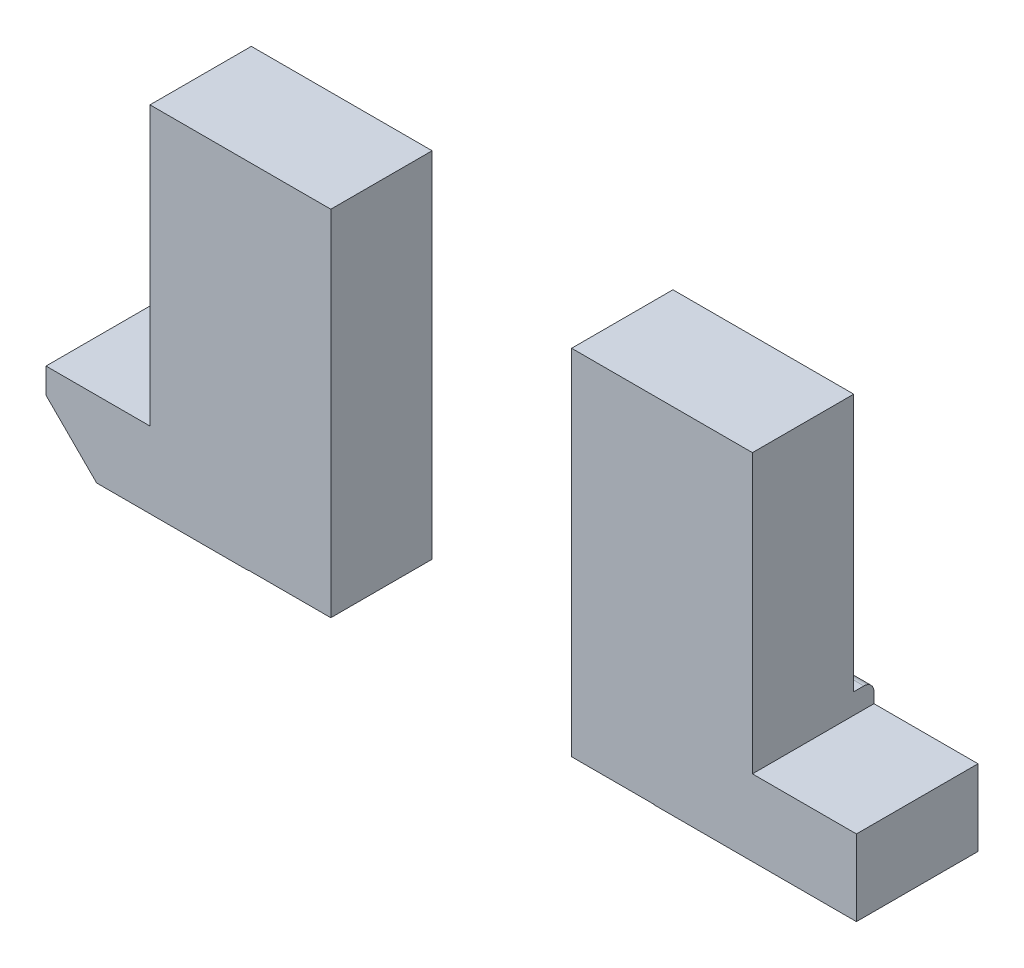
ISO-10303-21;
HEADER;
FILE_DESCRIPTION(('STEP AP214'),'2;1');
FILE_NAME('part.step','',(''),(''),'','','');
FILE_SCHEMA(('AUTOMOTIVE_DESIGN { 1 0 10303 214 1 1 1 1 }'));
ENDSEC;
DATA;
#1=APPLICATION_CONTEXT('core data for automotive mechanical design processes');
#2=APPLICATION_PROTOCOL_DEFINITION('international standard','automotive_design',2000,#1);
#3=PRODUCT_CONTEXT('',#1,'mechanical');
#4=PRODUCT('Part','Part','',(#3));
#5=PRODUCT_RELATED_PRODUCT_CATEGORY('part','',(#4));
#6=PRODUCT_DEFINITION_FORMATION('','',#4);
#7=PRODUCT_DEFINITION_CONTEXT('part definition',#1,'design');
#8=PRODUCT_DEFINITION('design','',#6,#7);
#9=PRODUCT_DEFINITION_SHAPE('','',#8);
#10=(LENGTH_UNIT() NAMED_UNIT(*) SI_UNIT(.MILLI.,.METRE.));
#11=(NAMED_UNIT(*) PLANE_ANGLE_UNIT() SI_UNIT($,.RADIAN.));
#12=(NAMED_UNIT(*) SI_UNIT($,.STERADIAN.) SOLID_ANGLE_UNIT());
#13=UNCERTAINTY_MEASURE_WITH_UNIT(LENGTH_MEASURE(1.E-05),#10,'distance_accuracy_value','');
#14=(GEOMETRIC_REPRESENTATION_CONTEXT(3) GLOBAL_UNCERTAINTY_ASSIGNED_CONTEXT((#13)) GLOBAL_UNIT_ASSIGNED_CONTEXT((#10,
#11,#12)) REPRESENTATION_CONTEXT('',''));
#15=CARTESIAN_POINT('',(0.,0.,0.));
#16=DIRECTION('',(0.,0.,1.));
#17=DIRECTION('',(1.,0.,0.));
#18=AXIS2_PLACEMENT_3D('',#15,#16,#17);
#19=CARTESIAN_POINT('',(-0.8,-0.2,0.));
#20=DIRECTION('',(0.,1.,0.));
#21=DIRECTION('',(1.,0.,0.));
#22=AXIS2_PLACEMENT_3D('',#19,#20,#21);
#23=PLANE('',#22);
#24=DIRECTION('',(1.,0.,0.));
#25=VECTOR('',#24,1.);
#26=CARTESIAN_POINT('',(0.,-0.2,0.02));
#27=LINE('',#26,#25);
#28=CARTESIAN_POINT('',(-0.8,-0.2,0.02));
#29=VERTEX_POINT('',#28);
#30=CARTESIAN_POINT('',(-0.594652416555,-0.2,0.02));
#31=VERTEX_POINT('',#30);
#32=EDGE_CURVE('P0_E200',#29,#31,#27,.T.);
#33=ORIENTED_EDGE('',*,*,#32,.F.);
#34=DIRECTION('',(0.,0.,-1.));
#35=VECTOR('',#34,1.);
#36=CARTESIAN_POINT('',(-0.8,-0.2,0.));
#37=LINE('',#36,#35);
#38=CARTESIAN_POINT('',(-0.8,-0.2,0.26));
#39=VERTEX_POINT('',#38);
#40=EDGE_CURVE('P0_E41',#39,#29,#37,.T.);
#41=ORIENTED_EDGE('',*,*,#40,.F.);
#42=DIRECTION('',(-1.,0.,0.));
#43=VECTOR('',#42,1.);
#44=CARTESIAN_POINT('',(0.,-0.2,0.26));
#45=LINE('',#44,#43);
#46=CARTESIAN_POINT('',(-0.594652416555,-0.2,0.26));
#47=VERTEX_POINT('',#46);
#48=EDGE_CURVE('P0_E226',#47,#39,#45,.T.);
#49=ORIENTED_EDGE('',*,*,#48,.F.);
#50=DIRECTION('',(0.,0.,1.));
#51=VECTOR('',#50,1.);
#52=CARTESIAN_POINT('',(-0.594652416555,-0.2,0.06885270012602));
#53=LINE('',#52,#51);
#54=EDGE_CURVE('P0_E27',#31,#47,#53,.T.);
#55=ORIENTED_EDGE('',*,*,#54,.F.);
#56=EDGE_LOOP('',(#33,#41,#49,#55));
#57=FACE_BOUND('',#56,.T.);
#58=ADVANCED_FACE('P0_F16',(#57),#23,.T.);
#59=CARTESIAN_POINT('',(-0.594652416555,-0.349252516346,0.26));
#60=DIRECTION('',(-1.,0.,0.));
#61=DIRECTION('',(0.,0.,1.));
#62=AXIS2_PLACEMENT_3D('',#59,#60,#61);
#63=PLANE('',#62);
#64=DIRECTION('',(0.,-1.,0.));
#65=VECTOR('',#64,1.);
#66=CARTESIAN_POINT('',(-0.594652416555,-0.129801770078,0.26));
#67=LINE('',#66,#65);
#68=CARTESIAN_POINT('',(-0.594652416555,0.349252516346,0.26));
#69=VERTEX_POINT('',#68);
#70=EDGE_CURVE('P0_E223',#69,#47,#67,.T.);
#71=ORIENTED_EDGE('',*,*,#70,.F.);
#72=DIRECTION('',(0.,0.,-1.));
#73=VECTOR('',#72,1.);
#74=CARTESIAN_POINT('',(-0.594652416555,0.349252516346,0.26));
#75=LINE('',#74,#73);
#76=CARTESIAN_POINT('',(-0.594652416555,0.349252516346,0.06));
#77=VERTEX_POINT('',#76);
#78=EDGE_CURVE('P0_E11',#69,#77,#75,.T.);
#79=ORIENTED_EDGE('',*,*,#78,.T.);
#80=DIRECTION('',(0.,1.,0.));
#81=VECTOR('',#80,1.);
#82=CARTESIAN_POINT('',(-0.594652416555,0.349252516346,0.06));
#83=LINE('',#82,#81);
#84=CARTESIAN_POINT('',(-0.594652416555,-0.159603540156,0.06));
#85=VERTEX_POINT('',#84);
#86=EDGE_CURVE('P0_E191',#85,#77,#83,.T.);
#87=ORIENTED_EDGE('',*,*,#86,.F.);
#88=DIRECTION('',(0.,0.,1.));
#89=VECTOR('',#88,1.);
#90=CARTESIAN_POINT('',(-0.594652416555,-0.159603540156,0.07885270012602));
#91=LINE('',#90,#89);
#92=CARTESIAN_POINT('',(-0.594652416555,-0.159603540156,0.04));
#93=VERTEX_POINT('',#92);
#94=EDGE_CURVE('P0_E269',#93,#85,#91,.T.);
#95=ORIENTED_EDGE('',*,*,#94,.F.);
#96=CARTESIAN_POINT('',(-0.594652416555,-0.179603540156,0.04));
#97=DIRECTION('',(1.,0.,0.));
#98=DIRECTION('',(0.,0.707106781186548,-0.707106781186548));
#99=AXIS2_PLACEMENT_3D('',#96,#97,#98);
#100=CIRCLE('',#99,0.02);
#101=CARTESIAN_POINT('',(-0.594652416555,-0.179603540156,0.02));
#102=VERTEX_POINT('',#101);
#103=EDGE_CURVE('P0_E175',#102,#93,#100,.T.);
#104=ORIENTED_EDGE('',*,*,#103,.F.);
#105=DIRECTION('',(0.,1.,0.));
#106=VECTOR('',#105,1.);
#107=CARTESIAN_POINT('',(-0.594652416555,-0.225,0.02));
#108=LINE('',#107,#106);
#109=EDGE_CURVE('P0_E217',#31,#102,#108,.T.);
#110=ORIENTED_EDGE('',*,*,#109,.F.);
#111=ORIENTED_EDGE('',*,*,#54,.T.);
#112=EDGE_LOOP('',(#71,#79,#87,#95,#104,#110,#111));
#113=FACE_BOUND('',#112,.T.);
#114=ADVANCED_FACE('P0_F291',(#113),#63,.T.);
#115=CARTESIAN_POINT('',(0.8,-0.159603540156,0.26));
#116=DIRECTION('',(0.,0.,1.));
#117=DIRECTION('',(1.,0.,0.));
#118=AXIS2_PLACEMENT_3D('',#115,#116,#117);
#119=PLANE('',#118);
#120=ORIENTED_EDGE('',*,*,#70,.T.);
#121=ORIENTED_EDGE('',*,*,#48,.T.);
#122=DIRECTION('',(0.,-1.,0.));
#123=VECTOR('',#122,1.);
#124=CARTESIAN_POINT('',(-0.8,0.2,0.26));
#125=LINE('',#124,#123);
#126=CARTESIAN_POINT('',(-0.8,-0.25,0.26));
#127=VERTEX_POINT('',#126);
#128=EDGE_CURVE('P0_E161',#39,#127,#125,.T.);
#129=ORIENTED_EDGE('',*,*,#128,.T.);
#130=DIRECTION('',(-0.707106781186548,0.707106781186548,0.));
#131=VECTOR('',#130,1.);
#132=CARTESIAN_POINT('',(-0.712899120865,-0.337100879135,0.26));
#133=LINE('',#132,#131);
#134=CARTESIAN_POINT('',(-0.7,-0.35,0.26));
#135=VERTEX_POINT('',#134);
#136=EDGE_CURVE('P0_E201',#135,#127,#133,.T.);
#137=ORIENTED_EDGE('',*,*,#136,.F.);
#138=DIRECTION('',(-1.,0.,0.));
#139=VECTOR('',#138,1.);
#140=CARTESIAN_POINT('',(-0.7,-0.35,0.26));
#141=LINE('',#140,#139);
#142=CARTESIAN_POINT('',(-0.4,-0.35,0.26));
#143=VERTEX_POINT('',#142);
#144=EDGE_CURVE('P0_E156',#143,#135,#141,.T.);
#145=ORIENTED_EDGE('',*,*,#144,.F.);
#146=DIRECTION('',(0.,1.,0.));
#147=VECTOR('',#146,1.);
#148=CARTESIAN_POINT('',(-0.4,0.172033539864,0.26));
#149=LINE('',#148,#147);
#150=CARTESIAN_POINT('',(-0.4,-0.349252516346,0.26));
#151=VERTEX_POINT('',#150);
#152=EDGE_CURVE('P0_E149',#143,#151,#149,.T.);
#153=ORIENTED_EDGE('',*,*,#152,.T.);
#154=DIRECTION('',(1.,0.,0.));
#155=VECTOR('',#154,1.);
#156=CARTESIAN_POINT('',(-0.594652416555,-0.349252516346,0.26));
#157=LINE('',#156,#155);
#158=CARTESIAN_POINT('',(-0.237707110887,-0.349252516346,0.26));
#159=VERTEX_POINT('',#158);
#160=EDGE_CURVE('P0_E140',#151,#159,#157,.T.);
#161=ORIENTED_EDGE('',*,*,#160,.T.);
#162=DIRECTION('',(0.,1.,0.));
#163=VECTOR('',#162,1.);
#164=CARTESIAN_POINT('',(-0.237707110887,-0.349252516346,0.26));
#165=LINE('',#164,#163);
#166=CARTESIAN_POINT('',(-0.237707110887,0.349252516346,0.26));
#167=VERTEX_POINT('',#166);
#168=EDGE_CURVE('P0_E150',#159,#167,#165,.T.);
#169=ORIENTED_EDGE('',*,*,#168,.T.);
#170=DIRECTION('',(-1.,0.,0.));
#171=VECTOR('',#170,1.);
#172=CARTESIAN_POINT('',(-0.237707110887,0.349252516346,0.26));
#173=LINE('',#172,#171);
#174=EDGE_CURVE('P0_E194',#167,#69,#173,.T.);
#175=ORIENTED_EDGE('',*,*,#174,.T.);
#176=EDGE_LOOP('',(#120,#121,#129,#137,#145,#153,#161,#169,#175));
#177=FACE_BOUND('',#176,.T.);
#178=ADVANCED_FACE('P0_F154',(#177),#119,.T.);
#179=CARTESIAN_POINT('',(-0.237707110887,-0.349252516346,0.26));
#180=DIRECTION('',(0.,-1.,0.));
#181=DIRECTION('',(0.,0.,-1.));
#182=AXIS2_PLACEMENT_3D('',#179,#180,#181);
#183=PLANE('',#182);
#184=DIRECTION('',(0.,0.,1.));
#185=VECTOR('',#184,1.);
#186=CARTESIAN_POINT('',(-0.4,-0.349252516346,0.13));
#187=LINE('',#186,#185);
#188=CARTESIAN_POINT('',(-0.4,-0.349252516346,0.06));
#189=VERTEX_POINT('',#188);
#190=EDGE_CURVE('P0_E144',#189,#151,#187,.T.);
#191=ORIENTED_EDGE('',*,*,#190,.F.);
#192=DIRECTION('',(-1.,0.,0.));
#193=VECTOR('',#192,1.);
#194=CARTESIAN_POINT('',(-0.594652416555,-0.349252516346,0.06));
#195=LINE('',#194,#193);
#196=CARTESIAN_POINT('',(-0.237707110887,-0.349252516346,0.06));
#197=VERTEX_POINT('',#196);
#198=EDGE_CURVE('P0_E179',#197,#189,#195,.T.);
#199=ORIENTED_EDGE('',*,*,#198,.F.);
#200=DIRECTION('',(0.,0.,-1.));
#201=VECTOR('',#200,1.);
#202=CARTESIAN_POINT('',(-0.237707110887,-0.349252516346,0.26));
#203=LINE('',#202,#201);
#204=EDGE_CURVE('P0_E145',#159,#197,#203,.T.);
#205=ORIENTED_EDGE('',*,*,#204,.F.);
#206=ORIENTED_EDGE('',*,*,#160,.F.);
#207=EDGE_LOOP('',(#191,#199,#205,#206));
#208=FACE_BOUND('',#207,.T.);
#209=ADVANCED_FACE('P0_F142',(#208),#183,.T.);
#210=CARTESIAN_POINT('',(-0.237707110887,0.349252516346,0.26));
#211=DIRECTION('',(1.,0.,0.));
#212=DIRECTION('',(0.,1.,0.));
#213=AXIS2_PLACEMENT_3D('',#210,#211,#212);
#214=PLANE('',#213);
#215=ORIENTED_EDGE('',*,*,#168,.F.);
#216=ORIENTED_EDGE('',*,*,#204,.T.);
#217=DIRECTION('',(0.,-1.,0.));
#218=VECTOR('',#217,1.);
#219=CARTESIAN_POINT('',(-0.237707110887,-0.349252516346,0.06));
#220=LINE('',#219,#218);
#221=CARTESIAN_POINT('',(-0.237707110887,0.349252516346,0.06));
#222=VERTEX_POINT('',#221);
#223=EDGE_CURVE('P0_E91',#222,#197,#220,.T.);
#224=ORIENTED_EDGE('',*,*,#223,.F.);
#225=DIRECTION('',(0.,0.,-1.));
#226=VECTOR('',#225,1.);
#227=CARTESIAN_POINT('',(-0.237707110887,0.349252516346,0.26));
#228=LINE('',#227,#226);
#229=EDGE_CURVE('P0_E195',#167,#222,#228,.T.);
#230=ORIENTED_EDGE('',*,*,#229,.F.);
#231=EDGE_LOOP('',(#215,#216,#224,#230));
#232=FACE_BOUND('',#231,.T.);
#233=ADVANCED_FACE('P0_F280',(#232),#214,.T.);
#234=CARTESIAN_POINT('',(-0.594652416555,0.349252516346,0.26));
#235=DIRECTION('',(0.,1.,0.));
#236=DIRECTION('',(1.,0.,0.));
#237=AXIS2_PLACEMENT_3D('',#234,#235,#236);
#238=PLANE('',#237);
#239=ORIENTED_EDGE('',*,*,#174,.F.);
#240=ORIENTED_EDGE('',*,*,#229,.T.);
#241=DIRECTION('',(1.,0.,0.));
#242=VECTOR('',#241,1.);
#243=CARTESIAN_POINT('',(-0.237707110887,0.349252516346,0.06));
#244=LINE('',#243,#242);
#245=EDGE_CURVE('P0_E187',#77,#222,#244,.T.);
#246=ORIENTED_EDGE('',*,*,#245,.F.);
#247=ORIENTED_EDGE('',*,*,#78,.F.);
#248=EDGE_LOOP('',(#239,#240,#246,#247));
#249=FACE_BOUND('',#248,.T.);
#250=ADVANCED_FACE('P0_F283',(#249),#238,.T.);
#251=CARTESIAN_POINT('',(-0.416179763721,0.,0.06));
#252=DIRECTION('',(0.,0.,-1.));
#253=DIRECTION('',(0.,-1.,0.));
#254=AXIS2_PLACEMENT_3D('',#251,#252,#253);
#255=PLANE('',#254);
#256=DIRECTION('',(1.,0.,0.));
#257=VECTOR('',#256,1.);
#258=CARTESIAN_POINT('',(0.19191011814,-0.159603540156,0.06));
#259=LINE('',#258,#257);
#260=CARTESIAN_POINT('',(-0.4,-0.159603540156,0.06));
#261=VERTEX_POINT('',#260);
#262=EDGE_CURVE('P0_E266',#85,#261,#259,.T.);
#263=ORIENTED_EDGE('',*,*,#262,.F.);
#264=ORIENTED_EDGE('',*,*,#86,.T.);
#265=ORIENTED_EDGE('',*,*,#245,.T.);
#266=ORIENTED_EDGE('',*,*,#223,.T.);
#267=ORIENTED_EDGE('',*,*,#198,.T.);
#268=DIRECTION('',(0.,-1.,0.));
#269=VECTOR('',#268,1.);
#270=CARTESIAN_POINT('',(-0.4,0.251835309942,0.06));
#271=LINE('',#270,#269);
#272=EDGE_CURVE('P0_E106',#261,#189,#271,.T.);
#273=ORIENTED_EDGE('',*,*,#272,.F.);
#274=EDGE_LOOP('',(#263,#264,#265,#266,#267,#273));
#275=FACE_BOUND('',#274,.T.);
#276=ADVANCED_FACE('P0_F285',(#275),#255,.T.);
#277=CARTESIAN_POINT('',(0.8,-0.159603540156,0.02));
#278=DIRECTION('',(0.,1.,0.));
#279=DIRECTION('',(1.,0.,0.));
#280=AXIS2_PLACEMENT_3D('',#277,#278,#279);
#281=PLANE('',#280);
#282=ORIENTED_EDGE('',*,*,#94,.T.);
#283=ORIENTED_EDGE('',*,*,#262,.T.);
#284=DIRECTION('',(0.,0.,-1.));
#285=VECTOR('',#284,1.);
#286=CARTESIAN_POINT('',(-0.4,-0.159603540156,0.));
#287=LINE('',#286,#285);
#288=CARTESIAN_POINT('',(-0.4,-0.159603540156,0.04));
#289=VERTEX_POINT('',#288);
#290=EDGE_CURVE('P0_E173',#261,#289,#287,.T.);
#291=ORIENTED_EDGE('',*,*,#290,.T.);
#292=DIRECTION('',(1.,0.,0.));
#293=VECTOR('',#292,1.);
#294=CARTESIAN_POINT('',(0.8,-0.159603540156,0.04));
#295=LINE('',#294,#293);
#296=EDGE_CURVE('P0_E184',#93,#289,#295,.T.);
#297=ORIENTED_EDGE('',*,*,#296,.F.);
#298=EDGE_LOOP('',(#282,#283,#291,#297));
#299=FACE_BOUND('',#298,.T.);
#300=ADVANCED_FACE('P0_F372',(#299),#281,.T.);
#301=CARTESIAN_POINT('',(-0.4,0.503670619885,0.));
#302=DIRECTION('',(-1.,0.,0.));
#303=DIRECTION('',(0.,0.,1.));
#304=AXIS2_PLACEMENT_3D('',#301,#302,#303);
#305=PLANE('',#304);
#306=ORIENTED_EDGE('',*,*,#272,.T.);
#307=ORIENTED_EDGE('',*,*,#190,.T.);
#308=ORIENTED_EDGE('',*,*,#152,.F.);
#309=DIRECTION('',(0.,0.,-1.));
#310=VECTOR('',#309,1.);
#311=CARTESIAN_POINT('',(-0.4,-0.35,0.));
#312=LINE('',#311,#310);
#313=CARTESIAN_POINT('',(-0.4,-0.35,0.02));
#314=VERTEX_POINT('',#313);
#315=EDGE_CURVE('P0_E166',#143,#314,#312,.T.);
#316=ORIENTED_EDGE('',*,*,#315,.T.);
#317=DIRECTION('',(0.,-1.,0.));
#318=VECTOR('',#317,1.);
#319=CARTESIAN_POINT('',(-0.4,0.07683530994244,0.02));
#320=LINE('',#319,#318);
#321=CARTESIAN_POINT('',(-0.4,-0.179603540156,0.02));
#322=VERTEX_POINT('',#321);
#323=EDGE_CURVE('P0_E209',#322,#314,#320,.T.);
#324=ORIENTED_EDGE('',*,*,#323,.F.);
#325=CARTESIAN_POINT('',(-0.4,-0.179603540156,0.04));
#326=DIRECTION('',(-1.,0.,0.));
#327=DIRECTION('',(0.,0.707106781186548,-0.707106781186548));
#328=AXIS2_PLACEMENT_3D('',#325,#326,#327);
#329=CIRCLE('',#328,0.02);
#330=EDGE_CURVE('P0_E181',#289,#322,#329,.T.);
#331=ORIENTED_EDGE('',*,*,#330,.F.);
#332=ORIENTED_EDGE('',*,*,#290,.F.);
#333=EDGE_LOOP('',(#306,#307,#308,#316,#324,#331,#332));
#334=FACE_BOUND('',#333,.T.);
#335=ADVANCED_FACE('P0_F163',(#334),#305,.F.);
#336=CARTESIAN_POINT('',(0.8,-0.179603540156,0.04));
#337=DIRECTION('',(1.,0.,0.));
#338=DIRECTION('',(0.,0.707106781186548,-0.707106781186548));
#339=AXIS2_PLACEMENT_3D('',#336,#337,#338);
#340=CYLINDRICAL_SURFACE('',#339,0.02);
#341=ORIENTED_EDGE('',*,*,#103,.T.);
#342=ORIENTED_EDGE('',*,*,#296,.T.);
#343=ORIENTED_EDGE('',*,*,#330,.T.);
#344=DIRECTION('',(-1.,0.,0.));
#345=VECTOR('',#344,1.);
#346=CARTESIAN_POINT('',(0.8,-0.179603540156,0.02));
#347=LINE('',#346,#345);
#348=EDGE_CURVE('P0_E185',#322,#102,#347,.T.);
#349=ORIENTED_EDGE('',*,*,#348,.T.);
#350=EDGE_LOOP('',(#341,#342,#343,#349));
#351=FACE_BOUND('',#350,.T.);
#352=ADVANCED_FACE('P0_F382',(#351),#340,.T.);
#353=CARTESIAN_POINT('',(0.8,-0.35,0.02));
#354=DIRECTION('',(0.,0.,-1.));
#355=DIRECTION('',(0.,-1.,0.));
#356=AXIS2_PLACEMENT_3D('',#353,#354,#355);
#357=PLANE('',#356);
#358=ORIENTED_EDGE('',*,*,#109,.T.);
#359=ORIENTED_EDGE('',*,*,#348,.F.);
#360=ORIENTED_EDGE('',*,*,#323,.T.);
#361=DIRECTION('',(-1.,0.,0.));
#362=VECTOR('',#361,1.);
#363=CARTESIAN_POINT('',(0.,-0.35,0.02));
#364=LINE('',#363,#362);
#365=CARTESIAN_POINT('',(-0.7,-0.35,0.02));
#366=VERTEX_POINT('',#365);
#367=EDGE_CURVE('P0_E205',#314,#366,#364,.T.);
#368=ORIENTED_EDGE('',*,*,#367,.T.);
#369=DIRECTION('',(-0.707106781186548,0.707106781186548,0.));
#370=VECTOR('',#369,1.);
#371=CARTESIAN_POINT('',(-0.35,-0.7,0.02));
#372=LINE('',#371,#370);
#373=CARTESIAN_POINT('',(-0.8,-0.25,0.02));
#374=VERTEX_POINT('',#373);
#375=EDGE_CURVE('P0_E20',#366,#374,#372,.T.);
#376=ORIENTED_EDGE('',*,*,#375,.T.);
#377=DIRECTION('',(0.,1.,0.));
#378=VECTOR('',#377,1.);
#379=CARTESIAN_POINT('',(-0.8,0.025,0.02));
#380=LINE('',#379,#378);
#381=EDGE_CURVE('P0_E214',#374,#29,#380,.T.);
#382=ORIENTED_EDGE('',*,*,#381,.T.);
#383=ORIENTED_EDGE('',*,*,#32,.T.);
#384=EDGE_LOOP('',(#358,#359,#360,#368,#376,#382,#383));
#385=FACE_BOUND('',#384,.T.);
#386=ADVANCED_FACE('P0_F240',(#385),#357,.T.);
#387=CARTESIAN_POINT('',(-0.75,-0.3,0.));
#388=DIRECTION('',(-0.707106781186548,-0.707106781186548,0.));
#389=DIRECTION('',(-0.707106781186548,0.707106781186548,0.));
#390=AXIS2_PLACEMENT_3D('',#387,#388,#389);
#391=PLANE('',#390);
#392=ORIENTED_EDGE('',*,*,#375,.F.);
#393=DIRECTION('',(0.,0.,1.));
#394=VECTOR('',#393,1.);
#395=CARTESIAN_POINT('',(-0.7,-0.35,0.));
#396=LINE('',#395,#394);
#397=EDGE_CURVE('P0_E196',#366,#135,#396,.T.);
#398=ORIENTED_EDGE('',*,*,#397,.T.);
#399=ORIENTED_EDGE('',*,*,#136,.T.);
#400=DIRECTION('',(0.,0.,-1.));
#401=VECTOR('',#400,1.);
#402=CARTESIAN_POINT('',(-0.8,-0.25,0.));
#403=LINE('',#402,#401);
#404=EDGE_CURVE('P0_E204',#127,#374,#403,.T.);
#405=ORIENTED_EDGE('',*,*,#404,.T.);
#406=EDGE_LOOP('',(#392,#398,#399,#405));
#407=FACE_BOUND('',#406,.T.);
#408=ADVANCED_FACE('P0_F248',(#407),#391,.T.);
#409=CARTESIAN_POINT('',(-0.8,0.4,0.));
#410=DIRECTION('',(-1.,0.,0.));
#411=DIRECTION('',(0.,0.,1.));
#412=AXIS2_PLACEMENT_3D('',#409,#410,#411);
#413=PLANE('',#412);
#414=ORIENTED_EDGE('',*,*,#40,.T.);
#415=ORIENTED_EDGE('',*,*,#381,.F.);
#416=ORIENTED_EDGE('',*,*,#404,.F.);
#417=ORIENTED_EDGE('',*,*,#128,.F.);
#418=EDGE_LOOP('',(#414,#415,#416,#417));
#419=FACE_BOUND('',#418,.T.);
#420=ADVANCED_FACE('P0_F295',(#419),#413,.T.);
#421=CARTESIAN_POINT('',(-0.8,-0.35,0.));
#422=DIRECTION('',(0.,-1.,0.));
#423=DIRECTION('',(0.,0.,-1.));
#424=AXIS2_PLACEMENT_3D('',#421,#422,#423);
#425=PLANE('',#424);
#426=ORIENTED_EDGE('',*,*,#367,.F.);
#427=ORIENTED_EDGE('',*,*,#315,.F.);
#428=ORIENTED_EDGE('',*,*,#144,.T.);
#429=ORIENTED_EDGE('',*,*,#397,.F.);
#430=EDGE_LOOP('',(#426,#427,#428,#429));
#431=FACE_BOUND('',#430,.T.);
#432=ADVANCED_FACE('P0_F18',(#431),#425,.T.);
#433=CLOSED_SHELL('',(#58,#114,#178,#209,#233,#250,#276,#300,#335,#352,#386,#408,#420,#432));
#434=MANIFOLD_SOLID_BREP('P0_B1',#433);
#435=CARTESIAN_POINT('',(0.8,-0.2,0.));
#436=DIRECTION('',(0.,-1.,0.));
#437=DIRECTION('',(0.,0.,-1.));
#438=AXIS2_PLACEMENT_3D('',#435,#436,#437);
#439=PLANE('',#438);
#440=DIRECTION('',(-1.,0.,0.));
#441=VECTOR('',#440,1.);
#442=CARTESIAN_POINT('',(0.8,-0.2,0.26));
#443=LINE('',#442,#441);
#444=CARTESIAN_POINT('',(0.8,-0.2,0.26));
#445=VERTEX_POINT('',#444);
#446=CARTESIAN_POINT('',(0.594652416555,-0.2,0.26));
#447=VERTEX_POINT('',#446);
#448=EDGE_CURVE('P1_E40',#445,#447,#443,.T.);
#449=ORIENTED_EDGE('',*,*,#448,.F.);
#450=DIRECTION('',(0.,0.,1.));
#451=VECTOR('',#450,1.);
#452=CARTESIAN_POINT('',(0.8,-0.2,0.));
#453=LINE('',#452,#451);
#454=CARTESIAN_POINT('',(0.8,-0.2,0.02));
#455=VERTEX_POINT('',#454);
#456=EDGE_CURVE('P1_E247',#455,#445,#453,.T.);
#457=ORIENTED_EDGE('',*,*,#456,.F.);
#458=DIRECTION('',(1.,0.,0.));
#459=VECTOR('',#458,1.);
#460=CARTESIAN_POINT('',(0.8,-0.2,0.02));
#461=LINE('',#460,#459);
#462=CARTESIAN_POINT('',(0.594652416555,-0.2,0.02));
#463=VERTEX_POINT('',#462);
#464=EDGE_CURVE('P1_E100',#463,#455,#461,.T.);
#465=ORIENTED_EDGE('',*,*,#464,.F.);
#466=DIRECTION('',(0.,0.,1.));
#467=VECTOR('',#466,1.);
#468=CARTESIAN_POINT('',(0.594652416555,-0.2,0.06885270012602));
#469=LINE('',#468,#467);
#470=EDGE_CURVE('P1_E11',#463,#447,#469,.T.);
#471=ORIENTED_EDGE('',*,*,#470,.T.);
#472=EDGE_LOOP('',(#449,#457,#465,#471));
#473=FACE_BOUND('',#472,.T.);
#474=ADVANCED_FACE('P1_F16',(#473),#439,.F.);
#475=CARTESIAN_POINT('',(0.8,-0.159603540156,0.02));
#476=DIRECTION('',(0.,1.,0.));
#477=DIRECTION('',(1.,0.,0.));
#478=AXIS2_PLACEMENT_3D('',#475,#476,#477);
#479=PLANE('',#478);
#480=DIRECTION('',(0.,0.,-1.));
#481=VECTOR('',#480,1.);
#482=CARTESIAN_POINT('',(0.594652416555,-0.159603540156,0.07885270012602));
#483=LINE('',#482,#481);
#484=CARTESIAN_POINT('',(0.594652416555,-0.159603540156,0.06));
#485=VERTEX_POINT('',#484);
#486=CARTESIAN_POINT('',(0.594652416555,-0.159603540156,0.04));
#487=VERTEX_POINT('',#486);
#488=EDGE_CURVE('P1_E27',#485,#487,#483,.T.);
#489=ORIENTED_EDGE('',*,*,#488,.T.);
#490=DIRECTION('',(1.,0.,0.));
#491=VECTOR('',#490,1.);
#492=CARTESIAN_POINT('',(0.8,-0.159603540156,0.04));
#493=LINE('',#492,#491);
#494=CARTESIAN_POINT('',(0.4,-0.159603540156,0.04));
#495=VERTEX_POINT('',#494);
#496=EDGE_CURVE('P1_E161',#495,#487,#493,.T.);
#497=ORIENTED_EDGE('',*,*,#496,.F.);
#498=DIRECTION('',(0.,0.,1.));
#499=VECTOR('',#498,1.);
#500=CARTESIAN_POINT('',(0.4,-0.159603540156,0.01));
#501=LINE('',#500,#499);
#502=CARTESIAN_POINT('',(0.4,-0.159603540156,0.06));
#503=VERTEX_POINT('',#502);
#504=EDGE_CURVE('P1_E167',#495,#503,#501,.T.);
#505=ORIENTED_EDGE('',*,*,#504,.T.);
#506=DIRECTION('',(1.,0.,0.));
#507=VECTOR('',#506,1.);
#508=CARTESIAN_POINT('',(0.60808988186,-0.159603540156,0.06));
#509=LINE('',#508,#507);
#510=EDGE_CURVE('P1_E171',#503,#485,#509,.T.);
#511=ORIENTED_EDGE('',*,*,#510,.T.);
#512=EDGE_LOOP('',(#489,#497,#505,#511));
#513=FACE_BOUND('',#512,.T.);
#514=ADVANCED_FACE('P1_F200',(#513),#479,.T.);
#515=CARTESIAN_POINT('',(0.8,-0.179603540156,0.04));
#516=DIRECTION('',(1.,0.,0.));
#517=DIRECTION('',(0.,0.707106781186548,-0.707106781186548));
#518=AXIS2_PLACEMENT_3D('',#515,#516,#517);
#519=CYLINDRICAL_SURFACE('',#518,0.02);
#520=CARTESIAN_POINT('',(0.594652416555,-0.179603540156,0.04));
#521=DIRECTION('',(-1.,0.,0.));
#522=DIRECTION('',(0.,0.707106781186548,-0.707106781186548));
#523=AXIS2_PLACEMENT_3D('',#520,#521,#522);
#524=CIRCLE('',#523,0.02);
#525=CARTESIAN_POINT('',(0.594652416555,-0.179603540156,0.02));
#526=VERTEX_POINT('',#525);
#527=EDGE_CURVE('P1_E172',#487,#526,#524,.T.);
#528=ORIENTED_EDGE('',*,*,#527,.T.);
#529=DIRECTION('',(-1.,0.,0.));
#530=VECTOR('',#529,1.);
#531=CARTESIAN_POINT('',(0.8,-0.179603540156,0.02));
#532=LINE('',#531,#530);
#533=CARTESIAN_POINT('',(0.4,-0.179603540156,0.02));
#534=VERTEX_POINT('',#533);
#535=EDGE_CURVE('P1_E160',#526,#534,#532,.T.);
#536=ORIENTED_EDGE('',*,*,#535,.T.);
#537=CARTESIAN_POINT('',(0.4,-0.179603540156,0.04));
#538=DIRECTION('',(1.,0.,0.));
#539=DIRECTION('',(0.,0.707106781186548,-0.707106781186548));
#540=AXIS2_PLACEMENT_3D('',#537,#538,#539);
#541=CIRCLE('',#540,0.02);
#542=EDGE_CURVE('P1_E156',#534,#495,#541,.T.);
#543=ORIENTED_EDGE('',*,*,#542,.T.);
#544=ORIENTED_EDGE('',*,*,#496,.T.);
#545=EDGE_LOOP('',(#528,#536,#543,#544));
#546=FACE_BOUND('',#545,.T.);
#547=ADVANCED_FACE('P1_F186',(#546),#519,.T.);
#548=CARTESIAN_POINT('',(0.8,-0.35,0.02));
#549=DIRECTION('',(0.,0.,-1.));
#550=DIRECTION('',(0.,-1.,0.));
#551=AXIS2_PLACEMENT_3D('',#548,#549,#550);
#552=PLANE('',#551);
#553=DIRECTION('',(0.,-1.,0.));
#554=VECTOR('',#553,1.);
#555=CARTESIAN_POINT('',(0.594652416555,-0.225,0.02));
#556=LINE('',#555,#554);
#557=EDGE_CURVE('P1_E20',#526,#463,#556,.T.);
#558=ORIENTED_EDGE('',*,*,#557,.T.);
#559=ORIENTED_EDGE('',*,*,#464,.T.);
#560=DIRECTION('',(0.,-1.,0.));
#561=VECTOR('',#560,1.);
#562=CARTESIAN_POINT('',(0.8,-0.375,0.02));
#563=LINE('',#562,#561);
#564=CARTESIAN_POINT('',(0.8,-0.35,0.02));
#565=VERTEX_POINT('',#564);
#566=EDGE_CURVE('P1_E92',#455,#565,#563,.T.);
#567=ORIENTED_EDGE('',*,*,#566,.T.);
#568=DIRECTION('',(-1.,0.,0.));
#569=VECTOR('',#568,1.);
#570=CARTESIAN_POINT('',(0.,-0.35,0.02));
#571=LINE('',#570,#569);
#572=CARTESIAN_POINT('',(0.4,-0.35,0.02));
#573=VERTEX_POINT('',#572);
#574=EDGE_CURVE('P1_E81',#565,#573,#571,.T.);
#575=ORIENTED_EDGE('',*,*,#574,.T.);
#576=DIRECTION('',(0.,1.,0.));
#577=VECTOR('',#576,1.);
#578=CARTESIAN_POINT('',(0.4,-0.426835309942,0.02));
#579=LINE('',#578,#577);
#580=EDGE_CURVE('P1_E93',#573,#534,#579,.T.);
#581=ORIENTED_EDGE('',*,*,#580,.T.);
#582=ORIENTED_EDGE('',*,*,#535,.F.);
#583=EDGE_LOOP('',(#558,#559,#567,#575,#581,#582));
#584=FACE_BOUND('',#583,.T.);
#585=ADVANCED_FACE('P1_F98',(#584),#552,.T.);
#586=CARTESIAN_POINT('',(0.237707110887,-0.349252516346,0.26));
#587=DIRECTION('',(0.,1.,0.));
#588=DIRECTION('',(1.,0.,0.));
#589=AXIS2_PLACEMENT_3D('',#586,#587,#588);
#590=PLANE('',#589);
#591=DIRECTION('',(0.,0.,-1.));
#592=VECTOR('',#591,1.);
#593=CARTESIAN_POINT('',(0.4,-0.349252516346,0.13));
#594=LINE('',#593,#592);
#595=CARTESIAN_POINT('',(0.4,-0.349252516346,0.26));
#596=VERTEX_POINT('',#595);
#597=CARTESIAN_POINT('',(0.4,-0.349252516346,0.06));
#598=VERTEX_POINT('',#597);
#599=EDGE_CURVE('P1_E143',#596,#598,#594,.T.);
#600=ORIENTED_EDGE('',*,*,#599,.F.);
#601=DIRECTION('',(-1.,0.,0.));
#602=VECTOR('',#601,1.);
#603=CARTESIAN_POINT('',(0.594652416555,-0.349252516346,0.26));
#604=LINE('',#603,#602);
#605=CARTESIAN_POINT('',(0.237707110887,-0.349252516346,0.26));
#606=VERTEX_POINT('',#605);
#607=EDGE_CURVE('P1_E125',#596,#606,#604,.T.);
#608=ORIENTED_EDGE('',*,*,#607,.T.);
#609=DIRECTION('',(0.,0.,-1.));
#610=VECTOR('',#609,1.);
#611=CARTESIAN_POINT('',(0.237707110887,-0.349252516346,0.26));
#612=LINE('',#611,#610);
#613=CARTESIAN_POINT('',(0.237707110887,-0.349252516346,0.06));
#614=VERTEX_POINT('',#613);
#615=EDGE_CURVE('P1_E121',#606,#614,#612,.T.);
#616=ORIENTED_EDGE('',*,*,#615,.T.);
#617=DIRECTION('',(1.,0.,0.));
#618=VECTOR('',#617,1.);
#619=CARTESIAN_POINT('',(0.594652416555,-0.349252516346,0.06));
#620=LINE('',#619,#618);
#621=EDGE_CURVE('P1_E126',#614,#598,#620,.T.);
#622=ORIENTED_EDGE('',*,*,#621,.T.);
#623=EDGE_LOOP('',(#600,#608,#616,#622));
#624=FACE_BOUND('',#623,.T.);
#625=ADVANCED_FACE('P1_F289',(#624),#590,.F.);
#626=CARTESIAN_POINT('',(0.594652416555,-0.349252516346,0.26));
#627=DIRECTION('',(-1.,0.,0.));
#628=DIRECTION('',(0.,0.,1.));
#629=AXIS2_PLACEMENT_3D('',#626,#627,#628);
#630=PLANE('',#629);
#631=DIRECTION('',(0.,1.,0.));
#632=VECTOR('',#631,1.);
#633=CARTESIAN_POINT('',(0.594652416555,0.349252516346,0.06));
#634=LINE('',#633,#632);
#635=CARTESIAN_POINT('',(0.594652416555,0.349252516346,0.06));
#636=VERTEX_POINT('',#635);
#637=EDGE_CURVE('P1_E138',#485,#636,#634,.T.);
#638=ORIENTED_EDGE('',*,*,#637,.T.);
#639=DIRECTION('',(0.,0.,-1.));
#640=VECTOR('',#639,1.);
#641=CARTESIAN_POINT('',(0.594652416555,0.349252516346,0.26));
#642=LINE('',#641,#640);
#643=CARTESIAN_POINT('',(0.594652416555,0.349252516346,0.26));
#644=VERTEX_POINT('',#643);
#645=EDGE_CURVE('P1_E127',#644,#636,#642,.T.);
#646=ORIENTED_EDGE('',*,*,#645,.F.);
#647=DIRECTION('',(0.,1.,0.));
#648=VECTOR('',#647,1.);
#649=CARTESIAN_POINT('',(0.594652416555,-0.129801770078,0.26));
#650=LINE('',#649,#648);
#651=EDGE_CURVE('P1_E251',#447,#644,#650,.T.);
#652=ORIENTED_EDGE('',*,*,#651,.F.);
#653=ORIENTED_EDGE('',*,*,#470,.F.);
#654=ORIENTED_EDGE('',*,*,#557,.F.);
#655=ORIENTED_EDGE('',*,*,#527,.F.);
#656=ORIENTED_EDGE('',*,*,#488,.F.);
#657=EDGE_LOOP('',(#638,#646,#652,#653,#654,#655,#656));
#658=FACE_BOUND('',#657,.T.);
#659=ADVANCED_FACE('P1_F249',(#658),#630,.F.);
#660=CARTESIAN_POINT('',(0.237707110887,0.349252516346,0.26));
#661=DIRECTION('',(1.,0.,0.));
#662=DIRECTION('',(0.,1.,0.));
#663=AXIS2_PLACEMENT_3D('',#660,#661,#662);
#664=PLANE('',#663);
#665=DIRECTION('',(0.,1.,0.));
#666=VECTOR('',#665,1.);
#667=CARTESIAN_POINT('',(0.237707110887,-0.349252516346,0.26));
#668=LINE('',#667,#666);
#669=CARTESIAN_POINT('',(0.237707110887,0.349252516346,0.26));
#670=VERTEX_POINT('',#669);
#671=EDGE_CURVE('P1_E148',#606,#670,#668,.T.);
#672=ORIENTED_EDGE('',*,*,#671,.T.);
#673=DIRECTION('',(0.,0.,-1.));
#674=VECTOR('',#673,1.);
#675=CARTESIAN_POINT('',(0.237707110887,0.349252516346,0.26));
#676=LINE('',#675,#674);
#677=CARTESIAN_POINT('',(0.237707110887,0.349252516346,0.06));
#678=VERTEX_POINT('',#677);
#679=EDGE_CURVE('P1_E151',#670,#678,#676,.T.);
#680=ORIENTED_EDGE('',*,*,#679,.T.);
#681=DIRECTION('',(0.,-1.,0.));
#682=VECTOR('',#681,1.);
#683=CARTESIAN_POINT('',(0.237707110887,-0.349252516346,0.06));
#684=LINE('',#683,#682);
#685=EDGE_CURVE('P1_E141',#678,#614,#684,.T.);
#686=ORIENTED_EDGE('',*,*,#685,.T.);
#687=ORIENTED_EDGE('',*,*,#615,.F.);
#688=EDGE_LOOP('',(#672,#680,#686,#687));
#689=FACE_BOUND('',#688,.T.);
#690=ADVANCED_FACE('P1_F300',(#689),#664,.F.);
#691=CARTESIAN_POINT('',(0.594652416555,0.349252516346,0.26));
#692=DIRECTION('',(0.,-1.,0.));
#693=DIRECTION('',(0.,0.,-1.));
#694=AXIS2_PLACEMENT_3D('',#691,#692,#693);
#695=PLANE('',#694);
#696=DIRECTION('',(1.,0.,0.));
#697=VECTOR('',#696,1.);
#698=CARTESIAN_POINT('',(0.237707110887,0.349252516346,0.26));
#699=LINE('',#698,#697);
#700=EDGE_CURVE('P1_E131',#670,#644,#699,.T.);
#701=ORIENTED_EDGE('',*,*,#700,.T.);
#702=ORIENTED_EDGE('',*,*,#645,.T.);
#703=DIRECTION('',(-1.,0.,0.));
#704=VECTOR('',#703,1.);
#705=CARTESIAN_POINT('',(0.237707110887,0.349252516346,0.06));
#706=LINE('',#705,#704);
#707=EDGE_CURVE('P1_E132',#636,#678,#706,.T.);
#708=ORIENTED_EDGE('',*,*,#707,.T.);
#709=ORIENTED_EDGE('',*,*,#679,.F.);
#710=EDGE_LOOP('',(#701,#702,#708,#709));
#711=FACE_BOUND('',#710,.T.);
#712=ADVANCED_FACE('P1_F292',(#711),#695,.F.);
#713=CARTESIAN_POINT('',(0.416179763721,0.,0.06));
#714=DIRECTION('',(0.,0.,1.));
#715=DIRECTION('',(1.,0.,0.));
#716=AXIS2_PLACEMENT_3D('',#713,#714,#715);
#717=PLANE('',#716);
#718=DIRECTION('',(0.,1.,0.));
#719=VECTOR('',#718,1.);
#720=CARTESIAN_POINT('',(0.4,-0.251835309942,0.06));
#721=LINE('',#720,#719);
#722=EDGE_CURVE('P1_E147',#598,#503,#721,.T.);
#723=ORIENTED_EDGE('',*,*,#722,.F.);
#724=ORIENTED_EDGE('',*,*,#621,.F.);
#725=ORIENTED_EDGE('',*,*,#685,.F.);
#726=ORIENTED_EDGE('',*,*,#707,.F.);
#727=ORIENTED_EDGE('',*,*,#637,.F.);
#728=ORIENTED_EDGE('',*,*,#510,.F.);
#729=EDGE_LOOP('',(#723,#724,#725,#726,#727,#728));
#730=FACE_BOUND('',#729,.T.);
#731=ADVANCED_FACE('P1_F290',(#730),#717,.F.);
#732=CARTESIAN_POINT('',(0.4,-0.503670619885,0.));
#733=DIRECTION('',(1.,0.,0.));
#734=DIRECTION('',(0.,1.,0.));
#735=AXIS2_PLACEMENT_3D('',#732,#733,#734);
#736=PLANE('',#735);
#737=ORIENTED_EDGE('',*,*,#599,.T.);
#738=ORIENTED_EDGE('',*,*,#722,.T.);
#739=ORIENTED_EDGE('',*,*,#504,.F.);
#740=ORIENTED_EDGE('',*,*,#542,.F.);
#741=ORIENTED_EDGE('',*,*,#580,.F.);
#742=DIRECTION('',(0.,0.,-1.));
#743=VECTOR('',#742,1.);
#744=CARTESIAN_POINT('',(0.4,-0.35,0.));
#745=LINE('',#744,#743);
#746=CARTESIAN_POINT('',(0.4,-0.35,0.26));
#747=VERTEX_POINT('',#746);
#748=EDGE_CURVE('P1_E88',#747,#573,#745,.T.);
#749=ORIENTED_EDGE('',*,*,#748,.F.);
#750=DIRECTION('',(0.,-1.,0.));
#751=VECTOR('',#750,1.);
#752=CARTESIAN_POINT('',(0.4,-0.331637080021,0.26));
#753=LINE('',#752,#751);
#754=EDGE_CURVE('P1_E120',#596,#747,#753,.T.);
#755=ORIENTED_EDGE('',*,*,#754,.F.);
#756=EDGE_LOOP('',(#737,#738,#739,#740,#741,#749,#755));
#757=FACE_BOUND('',#756,.T.);
#758=ADVANCED_FACE('P1_F191',(#757),#736,.F.);
#759=CARTESIAN_POINT('',(0.8,-0.4,0.));
#760=DIRECTION('',(1.,0.,0.));
#761=DIRECTION('',(0.,1.,0.));
#762=AXIS2_PLACEMENT_3D('',#759,#760,#761);
#763=PLANE('',#762);
#764=ORIENTED_EDGE('',*,*,#456,.T.);
#765=DIRECTION('',(0.,1.,0.));
#766=VECTOR('',#765,1.);
#767=CARTESIAN_POINT('',(0.8,-0.2,0.26));
#768=LINE('',#767,#766);
#769=CARTESIAN_POINT('',(0.8,-0.35,0.26));
#770=VERTEX_POINT('',#769);
#771=EDGE_CURVE('P1_E106',#770,#445,#768,.T.);
#772=ORIENTED_EDGE('',*,*,#771,.F.);
#773=DIRECTION('',(0.,0.,1.));
#774=VECTOR('',#773,1.);
#775=CARTESIAN_POINT('',(0.8,-0.35,0.));
#776=LINE('',#775,#774);
#777=EDGE_CURVE('P1_E85',#565,#770,#776,.T.);
#778=ORIENTED_EDGE('',*,*,#777,.F.);
#779=ORIENTED_EDGE('',*,*,#566,.F.);
#780=EDGE_LOOP('',(#764,#772,#778,#779));
#781=FACE_BOUND('',#780,.T.);
#782=ADVANCED_FACE('P1_F104',(#781),#763,.T.);
#783=CARTESIAN_POINT('',(0.8,-0.159603540156,0.26));
#784=DIRECTION('',(0.,0.,1.));
#785=DIRECTION('',(1.,0.,0.));
#786=AXIS2_PLACEMENT_3D('',#783,#784,#785);
#787=PLANE('',#786);
#788=ORIENTED_EDGE('',*,*,#651,.T.);
#789=ORIENTED_EDGE('',*,*,#700,.F.);
#790=ORIENTED_EDGE('',*,*,#671,.F.);
#791=ORIENTED_EDGE('',*,*,#607,.F.);
#792=ORIENTED_EDGE('',*,*,#754,.T.);
#793=DIRECTION('',(-1.,0.,0.));
#794=VECTOR('',#793,1.);
#795=CARTESIAN_POINT('',(-0.1,-0.35,0.26));
#796=LINE('',#795,#794);
#797=EDGE_CURVE('P1_E109',#770,#747,#796,.T.);
#798=ORIENTED_EDGE('',*,*,#797,.F.);
#799=ORIENTED_EDGE('',*,*,#771,.T.);
#800=ORIENTED_EDGE('',*,*,#448,.T.);
#801=EDGE_LOOP('',(#788,#789,#790,#791,#792,#798,#799,#800));
#802=FACE_BOUND('',#801,.T.);
#803=ADVANCED_FACE('P1_F284',(#802),#787,.T.);
#804=CARTESIAN_POINT('',(-0.8,-0.35,0.));
#805=DIRECTION('',(0.,-1.,0.));
#806=DIRECTION('',(0.,0.,-1.));
#807=AXIS2_PLACEMENT_3D('',#804,#805,#806);
#808=PLANE('',#807);
#809=ORIENTED_EDGE('',*,*,#574,.F.);
#810=ORIENTED_EDGE('',*,*,#777,.T.);
#811=ORIENTED_EDGE('',*,*,#797,.T.);
#812=ORIENTED_EDGE('',*,*,#748,.T.);
#813=EDGE_LOOP('',(#809,#810,#811,#812));
#814=FACE_BOUND('',#813,.T.);
#815=ADVANCED_FACE('P1_F18',(#814),#808,.T.);
#816=CLOSED_SHELL('',(#474,#514,#547,#585,#625,#659,#690,#712,#731,#758,#782,#803,#815));
#817=MANIFOLD_SOLID_BREP('P1_B1',#816);
#818=ADVANCED_BREP_SHAPE_REPRESENTATION('',(#18,#434,#817),#14);
#819=SHAPE_DEFINITION_REPRESENTATION(#9,#818);
ENDSEC;
END-ISO-10303-21;
